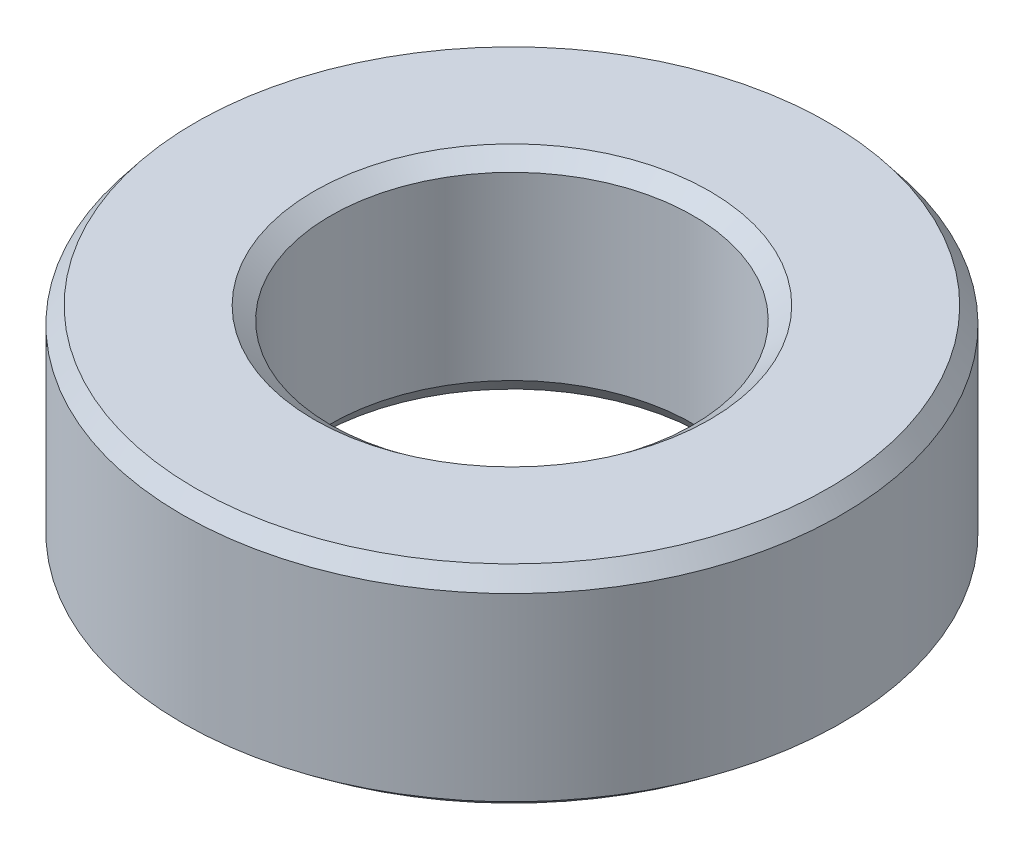
ISO-10303-21;
HEADER;
FILE_DESCRIPTION(('STEP AP214'),'2;1');
FILE_NAME('part.step','',(''),(''),'','','');
FILE_SCHEMA(('AUTOMOTIVE_DESIGN { 1 0 10303 214 1 1 1 1 }'));
ENDSEC;
DATA;
#1=APPLICATION_CONTEXT('core data for automotive mechanical design processes');
#2=APPLICATION_PROTOCOL_DEFINITION('international standard','automotive_design',2000,#1);
#3=PRODUCT_CONTEXT('',#1,'mechanical');
#4=PRODUCT('Part','Part','',(#3));
#5=PRODUCT_RELATED_PRODUCT_CATEGORY('part','',(#4));
#6=PRODUCT_DEFINITION_FORMATION('','',#4);
#7=PRODUCT_DEFINITION_CONTEXT('part definition',#1,'design');
#8=PRODUCT_DEFINITION('design','',#6,#7);
#9=PRODUCT_DEFINITION_SHAPE('','',#8);
#10=(LENGTH_UNIT() NAMED_UNIT(*) SI_UNIT(.MILLI.,.METRE.));
#11=(NAMED_UNIT(*) PLANE_ANGLE_UNIT() SI_UNIT($,.RADIAN.));
#12=(NAMED_UNIT(*) SI_UNIT($,.STERADIAN.) SOLID_ANGLE_UNIT());
#13=UNCERTAINTY_MEASURE_WITH_UNIT(LENGTH_MEASURE(1.E-05),#10,'distance_accuracy_value','');
#14=(GEOMETRIC_REPRESENTATION_CONTEXT(3) GLOBAL_UNCERTAINTY_ASSIGNED_CONTEXT((#13)) GLOBAL_UNIT_ASSIGNED_CONTEXT((#10,
#11,#12)) REPRESENTATION_CONTEXT('',''));
#15=CARTESIAN_POINT('',(0.,0.,0.));
#16=DIRECTION('',(0.,0.,1.));
#17=DIRECTION('',(1.,0.,0.));
#18=AXIS2_PLACEMENT_3D('',#15,#16,#17);
#19=CARTESIAN_POINT('',(0.,31.8293422619991,0.));
#20=DIRECTION('',(0.,-1.,0.));
#21=DIRECTION('',(0.,0.,-1.));
#22=AXIS2_PLACEMENT_3D('',#19,#20,#21);
#23=CYLINDRICAL_SURFACE('',#22,50.);
#24=CARTESIAN_POINT('',(0.,1.96024275410742,0.));
#25=DIRECTION('',(0.,1.,0.));
#26=DIRECTION('',(0.,0.,1.));
#27=AXIS2_PLACEMENT_3D('',#24,#25,#26);
#28=CIRCLE('',#27,50.);
#29=CARTESIAN_POINT('',(0.,1.96024275410742,50.));
#30=VERTEX_POINT('',#29);
#31=EDGE_CURVE('E10',#30,#30,#28,.T.);
#32=ORIENTED_EDGE('',*,*,#31,.T.);
#33=EDGE_LOOP('',(#32));
#34=FACE_BOUND('',#33,.T.);
#35=CARTESIAN_POINT('',(0.,29.3128834094003,0.));
#36=DIRECTION('',(0.,1.,0.));
#37=DIRECTION('',(0.,0.,1.));
#38=AXIS2_PLACEMENT_3D('',#35,#36,#37);
#39=CIRCLE('',#38,50.);
#40=CARTESIAN_POINT('',(0.,29.3128834094003,50.));
#41=VERTEX_POINT('',#40);
#42=EDGE_CURVE('E50',#41,#41,#39,.F.);
#43=ORIENTED_EDGE('',*,*,#42,.T.);
#44=EDGE_LOOP('',(#43));
#45=FACE_BOUND('',#44,.T.);
#46=ADVANCED_FACE('F39',(#34,#45),#23,.T.);
#47=CARTESIAN_POINT('',(0.,31.8293422619991,0.));
#48=DIRECTION('',(0.,1.,0.));
#49=DIRECTION('',(0.,0.,1.));
#50=AXIS2_PLACEMENT_3D('',#47,#48,#49);
#51=PLANE('',#50);
#52=CARTESIAN_POINT('',(0.,31.8293422619991,0.));
#53=DIRECTION('',(0.,1.,0.));
#54=DIRECTION('',(0.,0.,1.));
#55=AXIS2_PLACEMENT_3D('',#52,#53,#54);
#56=CIRCLE('',#55,30.0181656999698);
#57=CARTESIAN_POINT('',(0.,31.8293422619991,30.0181656999698));
#58=VERTEX_POINT('',#57);
#59=EDGE_CURVE('E58',#58,#58,#56,.F.);
#60=ORIENTED_EDGE('',*,*,#59,.T.);
#61=EDGE_LOOP('',(#60));
#62=FACE_BOUND('',#61,.T.);
#63=CARTESIAN_POINT('',(0.,31.8293422619991,0.));
#64=DIRECTION('',(0.,1.,0.));
#65=DIRECTION('',(0.,0.,1.));
#66=AXIS2_PLACEMENT_3D('',#63,#64,#65);
#67=CIRCLE('',#66,48.0397572458926);
#68=CARTESIAN_POINT('',(0.,31.8293422619991,48.0397572458926));
#69=VERTEX_POINT('',#68);
#70=EDGE_CURVE('E61',#69,#69,#67,.T.);
#71=ORIENTED_EDGE('',*,*,#70,.T.);
#72=EDGE_LOOP('',(#71));
#73=FACE_BOUND('',#72,.T.);
#74=ADVANCED_FACE('F88',(#62,#73),#51,.T.);
#75=CARTESIAN_POINT('',(0.,0.,0.));
#76=DIRECTION('',(0.,1.,0.));
#77=DIRECTION('',(0.,0.,1.));
#78=AXIS2_PLACEMENT_3D('',#75,#76,#77);
#79=PLANE('',#78);
#80=CARTESIAN_POINT('',(0.,0.,0.));
#81=DIRECTION('',(0.,1.,0.));
#82=DIRECTION('',(0.,0.,1.));
#83=AXIS2_PLACEMENT_3D('',#80,#81,#82);
#84=CIRCLE('',#83,29.4619496014784);
#85=CARTESIAN_POINT('',(0.,0.,29.4619496014784));
#86=VERTEX_POINT('',#85);
#87=EDGE_CURVE('E51',#86,#86,#84,.T.);
#88=ORIENTED_EDGE('',*,*,#87,.T.);
#89=EDGE_LOOP('',(#88));
#90=FACE_BOUND('',#89,.T.);
#91=CARTESIAN_POINT('',(0.,0.,0.));
#92=DIRECTION('',(0.,1.,0.));
#93=DIRECTION('',(0.,0.,1.));
#94=AXIS2_PLACEMENT_3D('',#91,#92,#93);
#95=CIRCLE('',#94,47.4835411474012);
#96=CARTESIAN_POINT('',(0.,0.,47.4835411474012));
#97=VERTEX_POINT('',#96);
#98=EDGE_CURVE('E54',#97,#97,#95,.F.);
#99=ORIENTED_EDGE('',*,*,#98,.T.);
#100=EDGE_LOOP('',(#99));
#101=FACE_BOUND('',#100,.T.);
#102=ADVANCED_FACE('F83',(#90,#101),#79,.F.);
#103=CARTESIAN_POINT('',(0.,31.8293422619991,0.));
#104=DIRECTION('',(0.,-1.,0.));
#105=DIRECTION('',(0.,0.,-1.));
#106=AXIS2_PLACEMENT_3D('',#103,#104,#105);
#107=CYLINDRICAL_SURFACE('',#106,27.501706847371);
#108=CARTESIAN_POINT('',(0.,29.8690995078917,0.));
#109=DIRECTION('',(0.,1.,0.));
#110=DIRECTION('',(0.,0.,1.));
#111=AXIS2_PLACEMENT_3D('',#108,#109,#110);
#112=CIRCLE('',#111,27.501706847371);
#113=CARTESIAN_POINT('',(0.,29.8690995078917,27.501706847371));
#114=VERTEX_POINT('',#113);
#115=EDGE_CURVE('E67',#114,#114,#112,.T.);
#116=ORIENTED_EDGE('',*,*,#115,.T.);
#117=EDGE_LOOP('',(#116));
#118=FACE_BOUND('',#117,.T.);
#119=CARTESIAN_POINT('',(0.,2.51645885259873,0.));
#120=DIRECTION('',(0.,1.,0.));
#121=DIRECTION('',(0.,0.,1.));
#122=AXIS2_PLACEMENT_3D('',#119,#120,#121);
#123=CIRCLE('',#122,27.501706847371);
#124=CARTESIAN_POINT('',(0.,2.51645885259873,27.501706847371));
#125=VERTEX_POINT('',#124);
#126=EDGE_CURVE('E69',#125,#125,#123,.F.);
#127=ORIENTED_EDGE('',*,*,#126,.T.);
#128=EDGE_LOOP('',(#127));
#129=FACE_BOUND('',#128,.T.);
#130=ADVANCED_FACE('F71',(#118,#129),#107,.F.);
#131=CARTESIAN_POINT('',(0.,29.8690995078917,0.));
#132=DIRECTION('',(0.,1.,0.));
#133=DIRECTION('',(0.,0.,1.));
#134=AXIS2_PLACEMENT_3D('',#131,#132,#133);
#135=CONICAL_SURFACE('',#134,27.501706847371,0.909011531859969);
#136=ORIENTED_EDGE('',*,*,#59,.F.);
#137=EDGE_LOOP('',(#136));
#138=FACE_BOUND('',#137,.T.);
#139=ORIENTED_EDGE('',*,*,#115,.F.);
#140=EDGE_LOOP('',(#139));
#141=FACE_BOUND('',#140,.T.);
#142=ADVANCED_FACE('F77',(#138,#141),#135,.F.);
#143=CARTESIAN_POINT('',(0.,0.,0.));
#144=DIRECTION('',(0.,-1.,0.));
#145=DIRECTION('',(0.,0.,-1.));
#146=AXIS2_PLACEMENT_3D('',#143,#144,#145);
#147=CONICAL_SURFACE('',#146,29.4619496014784,0.661784794934928);
#148=ORIENTED_EDGE('',*,*,#126,.F.);
#149=EDGE_LOOP('',(#148));
#150=FACE_BOUND('',#149,.T.);
#151=ORIENTED_EDGE('',*,*,#87,.F.);
#152=EDGE_LOOP('',(#151));
#153=FACE_BOUND('',#152,.T.);
#154=ADVANCED_FACE('F73',(#150,#153),#147,.F.);
#155=CARTESIAN_POINT('',(0.,1.96024275410742,0.));
#156=DIRECTION('',(0.,1.,0.));
#157=DIRECTION('',(0.,0.,1.));
#158=AXIS2_PLACEMENT_3D('',#155,#156,#157);
#159=CONICAL_SURFACE('',#158,50.,0.909011531859969);
#160=ORIENTED_EDGE('',*,*,#98,.F.);
#161=EDGE_LOOP('',(#160));
#162=FACE_BOUND('',#161,.T.);
#163=ORIENTED_EDGE('',*,*,#31,.F.);
#164=EDGE_LOOP('',(#163));
#165=FACE_BOUND('',#164,.T.);
#166=ADVANCED_FACE('F76',(#162,#165),#159,.T.);
#167=CARTESIAN_POINT('',(0.,31.8293422619991,0.));
#168=DIRECTION('',(0.,-1.,0.));
#169=DIRECTION('',(0.,0.,-1.));
#170=AXIS2_PLACEMENT_3D('',#167,#168,#169);
#171=CONICAL_SURFACE('',#170,48.0397572458926,0.661784794934927);
#172=ORIENTED_EDGE('',*,*,#42,.F.);
#173=EDGE_LOOP('',(#172));
#174=FACE_BOUND('',#173,.T.);
#175=ORIENTED_EDGE('',*,*,#70,.F.);
#176=EDGE_LOOP('',(#175));
#177=FACE_BOUND('',#176,.T.);
#178=ADVANCED_FACE('F45',(#174,#177),#171,.T.);
#179=CLOSED_SHELL('',(#46,#74,#102,#130,#142,#154,#166,#178));
#180=MANIFOLD_SOLID_BREP('B2',#179);
#181=ADVANCED_BREP_SHAPE_REPRESENTATION('',(#18,#180),#14);
#182=SHAPE_DEFINITION_REPRESENTATION(#9,#181);
ENDSEC;
END-ISO-10303-21;
